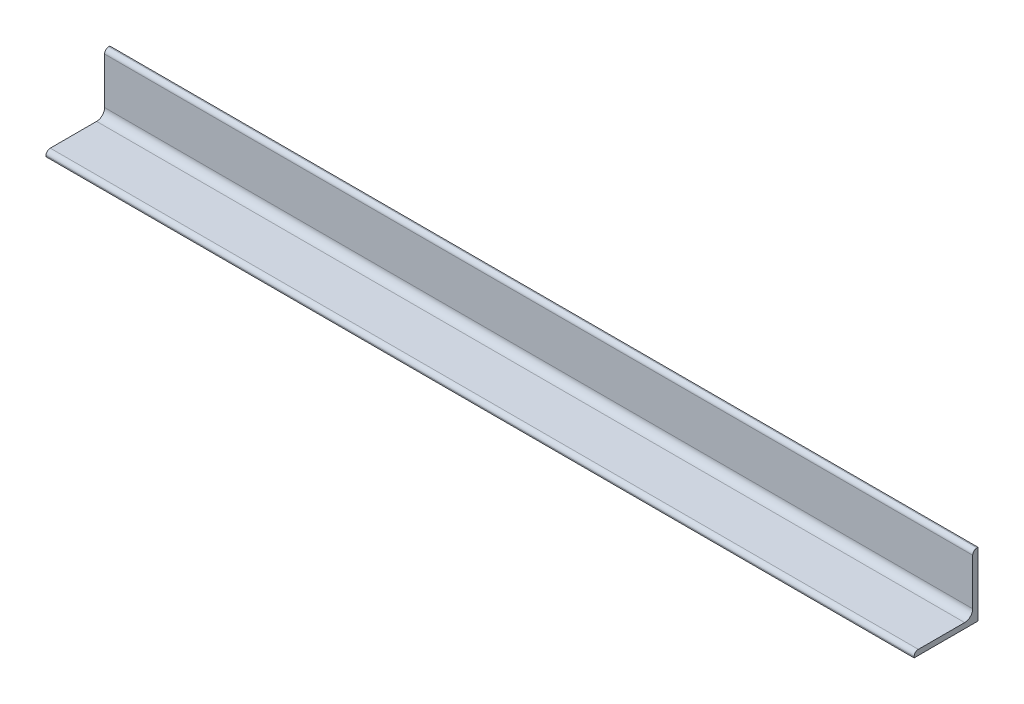
ISO-10303-21;
HEADER;
FILE_DESCRIPTION(('STEP AP214'),'2;1');
FILE_NAME('part.step','',(''),(''),'','','');
FILE_SCHEMA(('AUTOMOTIVE_DESIGN { 1 0 10303 214 1 1 1 1 }'));
ENDSEC;
DATA;
#1=APPLICATION_CONTEXT('core data for automotive mechanical design processes');
#2=APPLICATION_PROTOCOL_DEFINITION('international standard','automotive_design',2000,#1);
#3=PRODUCT_CONTEXT('',#1,'mechanical');
#4=PRODUCT('Part','Part','',(#3));
#5=PRODUCT_RELATED_PRODUCT_CATEGORY('part','',(#4));
#6=PRODUCT_DEFINITION_FORMATION('','',#4);
#7=PRODUCT_DEFINITION_CONTEXT('part definition',#1,'design');
#8=PRODUCT_DEFINITION('design','',#6,#7);
#9=PRODUCT_DEFINITION_SHAPE('','',#8);
#10=(LENGTH_UNIT() NAMED_UNIT(*) SI_UNIT(.MILLI.,.METRE.));
#11=(NAMED_UNIT(*) PLANE_ANGLE_UNIT() SI_UNIT($,.RADIAN.));
#12=(NAMED_UNIT(*) SI_UNIT($,.STERADIAN.) SOLID_ANGLE_UNIT());
#13=UNCERTAINTY_MEASURE_WITH_UNIT(LENGTH_MEASURE(1.E-05),#10,'distance_accuracy_value','');
#14=(GEOMETRIC_REPRESENTATION_CONTEXT(3) GLOBAL_UNCERTAINTY_ASSIGNED_CONTEXT((#13)) GLOBAL_UNIT_ASSIGNED_CONTEXT((#10,
#11,#12)) REPRESENTATION_CONTEXT('',''));
#15=CARTESIAN_POINT('',(0.,0.,0.));
#16=DIRECTION('',(0.,0.,1.));
#17=DIRECTION('',(1.,0.,0.));
#18=AXIS2_PLACEMENT_3D('',#15,#16,#17);
#19=CARTESIAN_POINT('',(517.525,76.2,3.175));
#20=DIRECTION('',(0.,-1.,0.));
#21=DIRECTION('',(0.,0.,-1.));
#22=AXIS2_PLACEMENT_3D('',#19,#20,#21);
#23=PLANE('',#22);
#24=DIRECTION('',(1.,0.,0.));
#25=VECTOR('',#24,1.);
#26=CARTESIAN_POINT('',(517.525,76.2,1.27));
#27=LINE('',#26,#25);
#28=CARTESIAN_POINT('',(517.525,76.2,1.27));
#29=VERTEX_POINT('',#28);
#30=CARTESIAN_POINT('',(-517.525,76.2,1.27));
#31=VERTEX_POINT('',#30);
#32=EDGE_CURVE('E102',#29,#31,#27,.F.);
#33=ORIENTED_EDGE('',*,*,#32,.F.);
#34=DIRECTION('',(0.,0.,-1.));
#35=VECTOR('',#34,1.);
#36=CARTESIAN_POINT('',(517.525,76.2,38.1));
#37=LINE('',#36,#35);
#38=CARTESIAN_POINT('',(517.525,76.2,0.));
#39=VERTEX_POINT('',#38);
#40=EDGE_CURVE('E81',#39,#29,#37,.F.);
#41=ORIENTED_EDGE('',*,*,#40,.F.);
#42=DIRECTION('',(1.,0.,0.));
#43=VECTOR('',#42,1.);
#44=CARTESIAN_POINT('',(517.525,76.2,0.));
#45=LINE('',#44,#43);
#46=CARTESIAN_POINT('',(-517.525,76.2,0.));
#47=VERTEX_POINT('',#46);
#48=EDGE_CURVE('E138',#39,#47,#45,.F.);
#49=ORIENTED_EDGE('',*,*,#48,.T.);
#50=DIRECTION('',(0.,0.,-1.));
#51=VECTOR('',#50,1.);
#52=CARTESIAN_POINT('',(-517.525,76.2,3.175));
#53=LINE('',#52,#51);
#54=EDGE_CURVE('E134',#31,#47,#53,.T.);
#55=ORIENTED_EDGE('',*,*,#54,.F.);
#56=EDGE_LOOP('',(#33,#41,#49,#55));
#57=FACE_BOUND('',#56,.T.);
#58=ADVANCED_FACE('F14',(#57),#23,.F.);
#59=CARTESIAN_POINT('',(517.525,15.875,15.875));
#60=DIRECTION('',(-1.,0.,0.));
#61=DIRECTION('',(0.,0.,1.));
#62=AXIS2_PLACEMENT_3D('',#59,#60,#61);
#63=CYLINDRICAL_SURFACE('',#62,9.525);
#64=DIRECTION('',(1.,0.,0.));
#65=VECTOR('',#64,1.);
#66=CARTESIAN_POINT('',(517.525,15.875,6.35));
#67=LINE('',#66,#65);
#68=CARTESIAN_POINT('',(517.525,15.875,6.35));
#69=VERTEX_POINT('',#68);
#70=CARTESIAN_POINT('',(-517.525,15.875,6.35));
#71=VERTEX_POINT('',#70);
#72=EDGE_CURVE('E101',#69,#71,#67,.F.);
#73=ORIENTED_EDGE('',*,*,#72,.T.);
#74=CARTESIAN_POINT('',(-517.525,15.875,15.875));
#75=DIRECTION('',(-1.,0.,0.));
#76=DIRECTION('',(0.,0.,1.));
#77=AXIS2_PLACEMENT_3D('',#74,#75,#76);
#78=CIRCLE('',#77,9.525);
#79=CARTESIAN_POINT('',(-517.525,6.35,15.875));
#80=VERTEX_POINT('',#79);
#81=EDGE_CURVE('E141',#71,#80,#78,.T.);
#82=ORIENTED_EDGE('',*,*,#81,.T.);
#83=DIRECTION('',(1.,0.,0.));
#84=VECTOR('',#83,1.);
#85=CARTESIAN_POINT('',(517.525,6.35,15.875));
#86=LINE('',#85,#84);
#87=CARTESIAN_POINT('',(517.525,6.35,15.875));
#88=VERTEX_POINT('',#87);
#89=EDGE_CURVE('E131',#80,#88,#86,.T.);
#90=ORIENTED_EDGE('',*,*,#89,.T.);
#91=CARTESIAN_POINT('',(517.525,15.875,15.875));
#92=DIRECTION('',(-1.,0.,0.));
#93=DIRECTION('',(0.,0.,1.));
#94=AXIS2_PLACEMENT_3D('',#91,#92,#93);
#95=CIRCLE('',#94,9.525);
#96=EDGE_CURVE('E106',#69,#88,#95,.T.);
#97=ORIENTED_EDGE('',*,*,#96,.F.);
#98=EDGE_LOOP('',(#73,#82,#90,#97));
#99=FACE_BOUND('',#98,.T.);
#100=ADVANCED_FACE('F216',(#99),#63,.F.);
#101=CARTESIAN_POINT('',(517.525,6.35,41.275));
#102=DIRECTION('',(0.,-1.,0.));
#103=DIRECTION('',(0.,0.,-1.));
#104=AXIS2_PLACEMENT_3D('',#101,#102,#103);
#105=PLANE('',#104);
#106=ORIENTED_EDGE('',*,*,#89,.F.);
#107=DIRECTION('',(0.,0.,-1.));
#108=VECTOR('',#107,1.);
#109=CARTESIAN_POINT('',(-517.525,6.35,38.1));
#110=LINE('',#109,#108);
#111=CARTESIAN_POINT('',(-517.525,6.35,71.12));
#112=VERTEX_POINT('',#111);
#113=EDGE_CURVE('E160',#80,#112,#110,.F.);
#114=ORIENTED_EDGE('',*,*,#113,.T.);
#115=DIRECTION('',(1.,0.,0.));
#116=VECTOR('',#115,1.);
#117=CARTESIAN_POINT('',(517.525,6.35,71.12));
#118=LINE('',#117,#116);
#119=CARTESIAN_POINT('',(517.525,6.35,71.12));
#120=VERTEX_POINT('',#119);
#121=EDGE_CURVE('E118',#120,#112,#118,.F.);
#122=ORIENTED_EDGE('',*,*,#121,.F.);
#123=DIRECTION('',(0.,0.,-1.));
#124=VECTOR('',#123,1.);
#125=CARTESIAN_POINT('',(517.525,6.35,38.1));
#126=LINE('',#125,#124);
#127=EDGE_CURVE('E108',#88,#120,#126,.F.);
#128=ORIENTED_EDGE('',*,*,#127,.F.);
#129=EDGE_LOOP('',(#106,#114,#122,#128));
#130=FACE_BOUND('',#129,.T.);
#131=ADVANCED_FACE('F170',(#130),#105,.F.);
#132=CARTESIAN_POINT('',(517.525,1.27,71.12));
#133=DIRECTION('',(1.,0.,0.));
#134=DIRECTION('',(0.,0.,-1.));
#135=AXIS2_PLACEMENT_3D('',#132,#133,#134);
#136=CYLINDRICAL_SURFACE('',#135,5.08);
#137=CARTESIAN_POINT('',(-517.525,1.27,71.12));
#138=DIRECTION('',(1.,0.,0.));
#139=DIRECTION('',(0.,0.,-1.));
#140=AXIS2_PLACEMENT_3D('',#137,#138,#139);
#141=CIRCLE('',#140,5.08);
#142=CARTESIAN_POINT('',(-517.525,1.27,76.2));
#143=VERTEX_POINT('',#142);
#144=EDGE_CURVE('E157',#112,#143,#141,.T.);
#145=ORIENTED_EDGE('',*,*,#144,.T.);
#146=DIRECTION('',(-1.,0.,0.));
#147=VECTOR('',#146,1.);
#148=CARTESIAN_POINT('',(517.525,1.27,76.2));
#149=LINE('',#148,#147);
#150=CARTESIAN_POINT('',(517.525,1.27,76.2));
#151=VERTEX_POINT('',#150);
#152=EDGE_CURVE('E113',#143,#151,#149,.F.);
#153=ORIENTED_EDGE('',*,*,#152,.T.);
#154=CARTESIAN_POINT('',(517.525,1.27,71.12));
#155=DIRECTION('',(1.,0.,0.));
#156=DIRECTION('',(0.,0.,-1.));
#157=AXIS2_PLACEMENT_3D('',#154,#155,#156);
#158=CIRCLE('',#157,5.08);
#159=EDGE_CURVE('E163',#120,#151,#158,.T.);
#160=ORIENTED_EDGE('',*,*,#159,.F.);
#161=ORIENTED_EDGE('',*,*,#121,.T.);
#162=EDGE_LOOP('',(#145,#153,#160,#161));
#163=FACE_BOUND('',#162,.T.);
#164=ADVANCED_FACE('F174',(#163),#136,.T.);
#165=CARTESIAN_POINT('',(517.525,71.12,1.27));
#166=DIRECTION('',(1.,0.,0.));
#167=DIRECTION('',(0.,0.,-1.));
#168=AXIS2_PLACEMENT_3D('',#165,#166,#167);
#169=CYLINDRICAL_SURFACE('',#168,5.08);
#170=CARTESIAN_POINT('',(-517.525,71.12,1.27));
#171=DIRECTION('',(1.,0.,0.));
#172=DIRECTION('',(0.,0.,-1.));
#173=AXIS2_PLACEMENT_3D('',#170,#171,#172);
#174=CIRCLE('',#173,5.08);
#175=CARTESIAN_POINT('',(-517.525,71.12,6.35));
#176=VERTEX_POINT('',#175);
#177=EDGE_CURVE('E97',#31,#176,#174,.T.);
#178=ORIENTED_EDGE('',*,*,#177,.T.);
#179=DIRECTION('',(1.,0.,0.));
#180=VECTOR('',#179,1.);
#181=CARTESIAN_POINT('',(517.525,71.12,6.35));
#182=LINE('',#181,#180);
#183=CARTESIAN_POINT('',(517.525,71.12,6.35));
#184=VERTEX_POINT('',#183);
#185=EDGE_CURVE('E94',#176,#184,#182,.T.);
#186=ORIENTED_EDGE('',*,*,#185,.T.);
#187=CARTESIAN_POINT('',(517.525,71.12,1.27));
#188=DIRECTION('',(1.,0.,0.));
#189=DIRECTION('',(0.,0.,-1.));
#190=AXIS2_PLACEMENT_3D('',#187,#188,#189);
#191=CIRCLE('',#190,5.08);
#192=EDGE_CURVE('E17',#29,#184,#191,.T.);
#193=ORIENTED_EDGE('',*,*,#192,.F.);
#194=ORIENTED_EDGE('',*,*,#32,.T.);
#195=EDGE_LOOP('',(#178,#186,#193,#194));
#196=FACE_BOUND('',#195,.T.);
#197=ADVANCED_FACE('F95',(#196),#169,.T.);
#198=CARTESIAN_POINT('',(517.525,41.275,6.35));
#199=DIRECTION('',(0.,0.,-1.));
#200=DIRECTION('',(0.,1.,0.));
#201=AXIS2_PLACEMENT_3D('',#198,#199,#200);
#202=PLANE('',#201);
#203=ORIENTED_EDGE('',*,*,#72,.F.);
#204=DIRECTION('',(0.,1.,0.));
#205=VECTOR('',#204,1.);
#206=CARTESIAN_POINT('',(517.525,38.1,6.35));
#207=LINE('',#206,#205);
#208=EDGE_CURVE('E89',#184,#69,#207,.F.);
#209=ORIENTED_EDGE('',*,*,#208,.F.);
#210=ORIENTED_EDGE('',*,*,#185,.F.);
#211=DIRECTION('',(0.,1.,0.));
#212=VECTOR('',#211,1.);
#213=CARTESIAN_POINT('',(-517.525,38.1,6.35));
#214=LINE('',#213,#212);
#215=EDGE_CURVE('E125',#176,#71,#214,.F.);
#216=ORIENTED_EDGE('',*,*,#215,.T.);
#217=EDGE_LOOP('',(#203,#209,#210,#216));
#218=FACE_BOUND('',#217,.T.);
#219=ADVANCED_FACE('F104',(#218),#202,.F.);
#220=CARTESIAN_POINT('',(517.525,3.175,76.2));
#221=DIRECTION('',(0.,0.,-1.));
#222=DIRECTION('',(-1.,0.,0.));
#223=AXIS2_PLACEMENT_3D('',#220,#221,#222);
#224=PLANE('',#223);
#225=ORIENTED_EDGE('',*,*,#152,.F.);
#226=DIRECTION('',(0.,1.,0.));
#227=VECTOR('',#226,1.);
#228=CARTESIAN_POINT('',(-517.525,38.1,76.2));
#229=LINE('',#228,#227);
#230=CARTESIAN_POINT('',(-517.525,0.,76.2));
#231=VERTEX_POINT('',#230);
#232=EDGE_CURVE('E153',#143,#231,#229,.F.);
#233=ORIENTED_EDGE('',*,*,#232,.T.);
#234=DIRECTION('',(1.,0.,0.));
#235=VECTOR('',#234,1.);
#236=CARTESIAN_POINT('',(517.525,0.,76.2));
#237=LINE('',#236,#235);
#238=CARTESIAN_POINT('',(517.525,0.,76.2));
#239=VERTEX_POINT('',#238);
#240=EDGE_CURVE('E121',#231,#239,#237,.T.);
#241=ORIENTED_EDGE('',*,*,#240,.T.);
#242=DIRECTION('',(0.,1.,0.));
#243=VECTOR('',#242,1.);
#244=CARTESIAN_POINT('',(517.525,38.1,76.2));
#245=LINE('',#244,#243);
#246=EDGE_CURVE('E146',#151,#239,#245,.F.);
#247=ORIENTED_EDGE('',*,*,#246,.F.);
#248=EDGE_LOOP('',(#225,#233,#241,#247));
#249=FACE_BOUND('',#248,.T.);
#250=ADVANCED_FACE('F179',(#249),#224,.F.);
#251=CARTESIAN_POINT('',(517.525,38.1,38.1));
#252=DIRECTION('',(1.,0.,0.));
#253=DIRECTION('',(0.,0.,-1.));
#254=AXIS2_PLACEMENT_3D('',#251,#252,#253);
#255=PLANE('',#254);
#256=DIRECTION('',(0.,0.,1.));
#257=VECTOR('',#256,1.);
#258=CARTESIAN_POINT('',(517.525,0.,38.1));
#259=LINE('',#258,#257);
#260=CARTESIAN_POINT('',(517.525,0.,0.));
#261=VERTEX_POINT('',#260);
#262=EDGE_CURVE('E124',#239,#261,#259,.F.);
#263=ORIENTED_EDGE('',*,*,#262,.T.);
#264=DIRECTION('',(0.,1.,0.));
#265=VECTOR('',#264,1.);
#266=CARTESIAN_POINT('',(517.525,38.1,0.));
#267=LINE('',#266,#265);
#268=EDGE_CURVE('E142',#261,#39,#267,.T.);
#269=ORIENTED_EDGE('',*,*,#268,.T.);
#270=ORIENTED_EDGE('',*,*,#40,.T.);
#271=ORIENTED_EDGE('',*,*,#192,.T.);
#272=ORIENTED_EDGE('',*,*,#208,.T.);
#273=ORIENTED_EDGE('',*,*,#96,.T.);
#274=ORIENTED_EDGE('',*,*,#127,.T.);
#275=ORIENTED_EDGE('',*,*,#159,.T.);
#276=ORIENTED_EDGE('',*,*,#246,.T.);
#277=EDGE_LOOP('',(#263,#269,#270,#271,#272,#273,#274,#275,#276));
#278=FACE_BOUND('',#277,.T.);
#279=ADVANCED_FACE('F87',(#278),#255,.T.);
#280=CARTESIAN_POINT('',(517.525,38.1,0.));
#281=DIRECTION('',(0.,0.,1.));
#282=DIRECTION('',(1.,0.,0.));
#283=AXIS2_PLACEMENT_3D('',#280,#281,#282);
#284=PLANE('',#283);
#285=ORIENTED_EDGE('',*,*,#48,.F.);
#286=ORIENTED_EDGE('',*,*,#268,.F.);
#287=DIRECTION('',(1.,0.,0.));
#288=VECTOR('',#287,1.);
#289=CARTESIAN_POINT('',(517.525,0.,0.));
#290=LINE('',#289,#288);
#291=CARTESIAN_POINT('',(-517.525,0.,0.));
#292=VERTEX_POINT('',#291);
#293=EDGE_CURVE('E23',#261,#292,#290,.F.);
#294=ORIENTED_EDGE('',*,*,#293,.T.);
#295=DIRECTION('',(0.,1.,0.));
#296=VECTOR('',#295,1.);
#297=CARTESIAN_POINT('',(-517.525,38.1,0.));
#298=LINE('',#297,#296);
#299=EDGE_CURVE('E31',#292,#47,#298,.T.);
#300=ORIENTED_EDGE('',*,*,#299,.T.);
#301=EDGE_LOOP('',(#285,#286,#294,#300));
#302=FACE_BOUND('',#301,.T.);
#303=ADVANCED_FACE('F195',(#302),#284,.F.);
#304=CARTESIAN_POINT('',(-517.525,38.1,38.1));
#305=DIRECTION('',(1.,0.,0.));
#306=DIRECTION('',(0.,0.,-1.));
#307=AXIS2_PLACEMENT_3D('',#304,#305,#306);
#308=PLANE('',#307);
#309=ORIENTED_EDGE('',*,*,#177,.F.);
#310=ORIENTED_EDGE('',*,*,#54,.T.);
#311=ORIENTED_EDGE('',*,*,#299,.F.);
#312=DIRECTION('',(0.,0.,1.));
#313=VECTOR('',#312,1.);
#314=CARTESIAN_POINT('',(-517.525,0.,38.1));
#315=LINE('',#314,#313);
#316=EDGE_CURVE('E9',#292,#231,#315,.T.);
#317=ORIENTED_EDGE('',*,*,#316,.T.);
#318=ORIENTED_EDGE('',*,*,#232,.F.);
#319=ORIENTED_EDGE('',*,*,#144,.F.);
#320=ORIENTED_EDGE('',*,*,#113,.F.);
#321=ORIENTED_EDGE('',*,*,#81,.F.);
#322=ORIENTED_EDGE('',*,*,#215,.F.);
#323=EDGE_LOOP('',(#309,#310,#311,#317,#318,#319,#320,#321,#322));
#324=FACE_BOUND('',#323,.T.);
#325=ADVANCED_FACE('F193',(#324),#308,.F.);
#326=CARTESIAN_POINT('',(517.525,0.,38.1));
#327=DIRECTION('',(0.,1.,0.));
#328=DIRECTION('',(0.,0.,1.));
#329=AXIS2_PLACEMENT_3D('',#326,#327,#328);
#330=PLANE('',#329);
#331=ORIENTED_EDGE('',*,*,#293,.F.);
#332=ORIENTED_EDGE('',*,*,#262,.F.);
#333=ORIENTED_EDGE('',*,*,#240,.F.);
#334=ORIENTED_EDGE('',*,*,#316,.F.);
#335=EDGE_LOOP('',(#331,#332,#333,#334));
#336=FACE_BOUND('',#335,.T.);
#337=ADVANCED_FACE('F183',(#336),#330,.F.);
#338=CLOSED_SHELL('',(#58,#100,#131,#164,#197,#219,#250,#279,#303,#325,#337));
#339=MANIFOLD_SOLID_BREP('B1',#338);
#340=ADVANCED_BREP_SHAPE_REPRESENTATION('',(#18,#339),#14);
#341=SHAPE_DEFINITION_REPRESENTATION(#9,#340);
ENDSEC;
END-ISO-10303-21;
